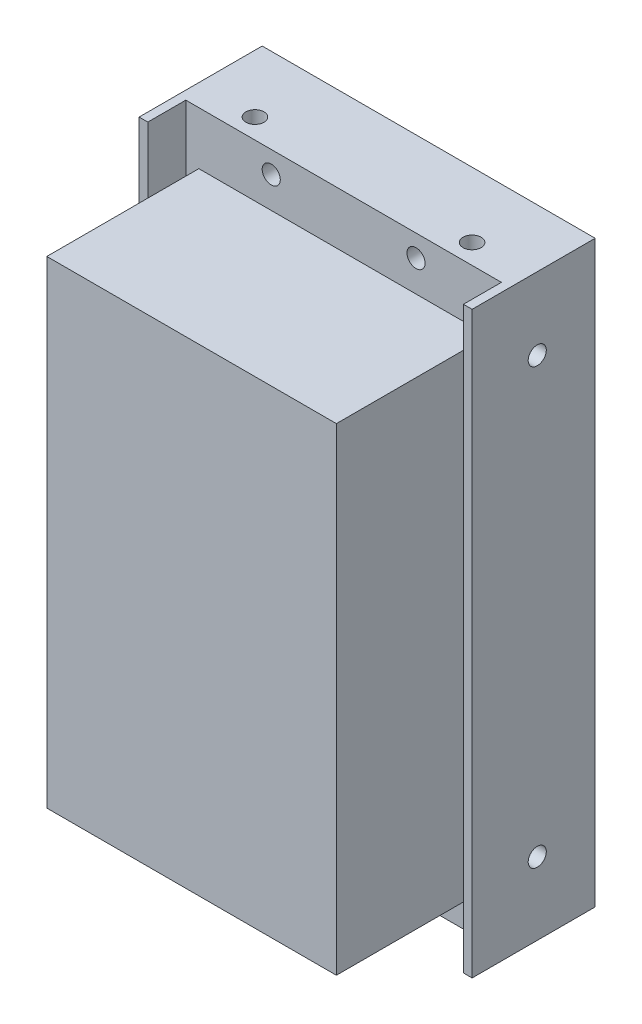
ISO-10303-21;
HEADER;
FILE_DESCRIPTION(('STEP AP214'),'2;1');
FILE_NAME('part.step','',(''),(''),'','','');
FILE_SCHEMA(('AUTOMOTIVE_DESIGN { 1 0 10303 214 1 1 1 1 }'));
ENDSEC;
DATA;
#1=APPLICATION_CONTEXT('core data for automotive mechanical design processes');
#2=APPLICATION_PROTOCOL_DEFINITION('international standard','automotive_design',2000,#1);
#3=PRODUCT_CONTEXT('',#1,'mechanical');
#4=PRODUCT('Part','Part','',(#3));
#5=PRODUCT_RELATED_PRODUCT_CATEGORY('part','',(#4));
#6=PRODUCT_DEFINITION_FORMATION('','',#4);
#7=PRODUCT_DEFINITION_CONTEXT('part definition',#1,'design');
#8=PRODUCT_DEFINITION('design','',#6,#7);
#9=PRODUCT_DEFINITION_SHAPE('','',#8);
#10=(LENGTH_UNIT() NAMED_UNIT(*) SI_UNIT(.MILLI.,.METRE.));
#11=(NAMED_UNIT(*) PLANE_ANGLE_UNIT() SI_UNIT($,.RADIAN.));
#12=(NAMED_UNIT(*) SI_UNIT($,.STERADIAN.) SOLID_ANGLE_UNIT());
#13=UNCERTAINTY_MEASURE_WITH_UNIT(LENGTH_MEASURE(1.E-05),#10,'distance_accuracy_value','');
#14=(GEOMETRIC_REPRESENTATION_CONTEXT(3) GLOBAL_UNCERTAINTY_ASSIGNED_CONTEXT((#13)) GLOBAL_UNIT_ASSIGNED_CONTEXT((#10,
#11,#12)) REPRESENTATION_CONTEXT('',''));
#15=CARTESIAN_POINT('',(0.,0.,0.));
#16=DIRECTION('',(0.,0.,1.));
#17=DIRECTION('',(1.,0.,0.));
#18=AXIS2_PLACEMENT_3D('',#15,#16,#17);
#19=CARTESIAN_POINT('',(-23.,80.,0.));
#20=DIRECTION('',(0.,0.,-1.));
#21=DIRECTION('',(-1.,0.,0.));
#22=AXIS2_PLACEMENT_3D('',#19,#20,#21);
#23=PLANE('',#22);
#24=CARTESIAN_POINT('',(-10.,77.,0.));
#25=DIRECTION('',(0.,0.,1.));
#26=DIRECTION('',(1.,0.,0.));
#27=AXIS2_PLACEMENT_3D('',#24,#25,#26);
#28=CIRCLE('',#27,1.24999999999999);
#29=CARTESIAN_POINT('',(-8.75000000000001,77.,0.));
#30=VERTEX_POINT('',#29);
#31=EDGE_CURVE('E149',#30,#30,#28,.T.);
#32=ORIENTED_EDGE('',*,*,#31,.F.);
#33=EDGE_LOOP('',(#32));
#34=FACE_BOUND('',#33,.T.);
#35=CARTESIAN_POINT('',(10.,77.,0.));
#36=DIRECTION('',(0.,0.,1.));
#37=DIRECTION('',(1.,0.,0.));
#38=AXIS2_PLACEMENT_3D('',#35,#36,#37);
#39=CIRCLE('',#38,1.24999999999999);
#40=CARTESIAN_POINT('',(11.25,77.,0.));
#41=VERTEX_POINT('',#40);
#42=EDGE_CURVE('E155',#41,#41,#39,.T.);
#43=ORIENTED_EDGE('',*,*,#42,.F.);
#44=EDGE_LOOP('',(#43));
#45=FACE_BOUND('',#44,.T.);
#46=CARTESIAN_POINT('',(-10.,3.,0.));
#47=DIRECTION('',(0.,0.,1.));
#48=DIRECTION('',(1.,0.,0.));
#49=AXIS2_PLACEMENT_3D('',#46,#47,#48);
#50=CIRCLE('',#49,1.24999999999999);
#51=CARTESIAN_POINT('',(-8.75000000000001,3.,0.));
#52=VERTEX_POINT('',#51);
#53=EDGE_CURVE('E161',#52,#52,#50,.T.);
#54=ORIENTED_EDGE('',*,*,#53,.F.);
#55=EDGE_LOOP('',(#54));
#56=FACE_BOUND('',#55,.T.);
#57=CARTESIAN_POINT('',(10.,3.,0.));
#58=DIRECTION('',(0.,0.,1.));
#59=DIRECTION('',(1.,0.,0.));
#60=AXIS2_PLACEMENT_3D('',#57,#58,#59);
#61=CIRCLE('',#60,1.24999999999999);
#62=CARTESIAN_POINT('',(11.25,3.,0.));
#63=VERTEX_POINT('',#62);
#64=EDGE_CURVE('E167',#63,#63,#61,.T.);
#65=ORIENTED_EDGE('',*,*,#64,.F.);
#66=EDGE_LOOP('',(#65));
#67=FACE_BOUND('',#66,.T.);
#68=DIRECTION('',(0.,-1.,0.));
#69=VECTOR('',#68,1.);
#70=CARTESIAN_POINT('',(21.8,80.,0.));
#71=LINE('',#70,#69);
#72=CARTESIAN_POINT('',(21.8,80.,0.));
#73=VERTEX_POINT('',#72);
#74=CARTESIAN_POINT('',(21.8,0.,0.));
#75=VERTEX_POINT('',#74);
#76=EDGE_CURVE('E217',#73,#75,#71,.T.);
#77=ORIENTED_EDGE('',*,*,#76,.F.);
#78=DIRECTION('',(1.,0.,0.));
#79=VECTOR('',#78,1.);
#80=CARTESIAN_POINT('',(-23.,80.,0.));
#81=LINE('',#80,#79);
#82=CARTESIAN_POINT('',(-21.8,80.,0.));
#83=VERTEX_POINT('',#82);
#84=EDGE_CURVE('E246',#83,#73,#81,.T.);
#85=ORIENTED_EDGE('',*,*,#84,.F.);
#86=DIRECTION('',(0.,-1.,0.));
#87=VECTOR('',#86,1.);
#88=CARTESIAN_POINT('',(-21.8,80.,0.));
#89=LINE('',#88,#87);
#90=CARTESIAN_POINT('',(-21.8,0.,0.));
#91=VERTEX_POINT('',#90);
#92=EDGE_CURVE('E226',#83,#91,#89,.T.);
#93=ORIENTED_EDGE('',*,*,#92,.T.);
#94=DIRECTION('',(1.,0.,0.));
#95=VECTOR('',#94,1.);
#96=CARTESIAN_POINT('',(-23.,0.,0.));
#97=LINE('',#96,#95);
#98=EDGE_CURVE('E242',#91,#75,#97,.T.);
#99=ORIENTED_EDGE('',*,*,#98,.T.);
#100=EDGE_LOOP('',(#77,#85,#93,#99));
#101=FACE_BOUND('',#100,.T.);
#102=DIRECTION('',(0.,-1.,0.));
#103=VECTOR('',#102,1.);
#104=CARTESIAN_POINT('',(-20.,72.7,0.));
#105=LINE('',#104,#103);
#106=CARTESIAN_POINT('',(-20.,72.7,0.));
#107=VERTEX_POINT('',#106);
#108=CARTESIAN_POINT('',(-20.,6.7,0.));
#109=VERTEX_POINT('',#108);
#110=EDGE_CURVE('E173',#107,#109,#105,.T.);
#111=ORIENTED_EDGE('',*,*,#110,.F.);
#112=DIRECTION('',(-1.,0.,0.));
#113=VECTOR('',#112,1.);
#114=CARTESIAN_POINT('',(-20.,72.7,0.));
#115=LINE('',#114,#113);
#116=CARTESIAN_POINT('',(20.,72.7,0.));
#117=VERTEX_POINT('',#116);
#118=EDGE_CURVE('E178',#117,#107,#115,.T.);
#119=ORIENTED_EDGE('',*,*,#118,.F.);
#120=DIRECTION('',(0.,1.,0.));
#121=VECTOR('',#120,1.);
#122=CARTESIAN_POINT('',(20.,72.7,0.));
#123=LINE('',#122,#121);
#124=CARTESIAN_POINT('',(20.,6.7,0.));
#125=VERTEX_POINT('',#124);
#126=EDGE_CURVE('E55',#125,#117,#123,.T.);
#127=ORIENTED_EDGE('',*,*,#126,.F.);
#128=DIRECTION('',(1.,0.,0.));
#129=VECTOR('',#128,1.);
#130=CARTESIAN_POINT('',(-20.,6.7,0.));
#131=LINE('',#130,#129);
#132=EDGE_CURVE('E50',#109,#125,#131,.T.);
#133=ORIENTED_EDGE('',*,*,#132,.F.);
#134=EDGE_LOOP('',(#111,#119,#127,#133));
#135=FACE_BOUND('',#134,.T.);
#136=ADVANCED_FACE('F35',(#34,#45,#56,#67,#101,#135),#23,.F.);
#137=CARTESIAN_POINT('',(23.,80.,-11.75));
#138=DIRECTION('',(-1.,0.,0.));
#139=DIRECTION('',(0.,0.,1.));
#140=AXIS2_PLACEMENT_3D('',#137,#138,#139);
#141=PLANE('',#140);
#142=CARTESIAN_POINT('',(23.,70.,-3.75));
#143=DIRECTION('',(1.,0.,0.));
#144=DIRECTION('',(0.,0.,-1.));
#145=AXIS2_PLACEMENT_3D('',#142,#143,#144);
#146=CIRCLE('',#145,1.24999999999999);
#147=CARTESIAN_POINT('',(23.,70.,-4.99999999999999));
#148=VERTEX_POINT('',#147);
#149=EDGE_CURVE('E524',#148,#148,#146,.T.);
#150=ORIENTED_EDGE('',*,*,#149,.F.);
#151=EDGE_LOOP('',(#150));
#152=FACE_BOUND('',#151,.T.);
#153=CARTESIAN_POINT('',(23.,10.,-3.75));
#154=DIRECTION('',(1.,0.,0.));
#155=DIRECTION('',(0.,0.,-1.));
#156=AXIS2_PLACEMENT_3D('',#153,#154,#155);
#157=CIRCLE('',#156,1.24999999999999);
#158=CARTESIAN_POINT('',(23.,10.,-4.99999999999999));
#159=VERTEX_POINT('',#158);
#160=EDGE_CURVE('E526',#159,#159,#157,.T.);
#161=ORIENTED_EDGE('',*,*,#160,.F.);
#162=EDGE_LOOP('',(#161));
#163=FACE_BOUND('',#162,.T.);
#164=DIRECTION('',(0.,0.,-1.));
#165=VECTOR('',#164,1.);
#166=CARTESIAN_POINT('',(23.,0.,-11.75));
#167=LINE('',#166,#165);
#168=CARTESIAN_POINT('',(23.,0.,5.25));
#169=VERTEX_POINT('',#168);
#170=CARTESIAN_POINT('',(23.,0.,-11.75));
#171=VERTEX_POINT('',#170);
#172=EDGE_CURVE('E237',#169,#171,#167,.T.);
#173=ORIENTED_EDGE('',*,*,#172,.T.);
#174=DIRECTION('',(0.,-1.,0.));
#175=VECTOR('',#174,1.);
#176=CARTESIAN_POINT('',(23.,80.,-11.75));
#177=LINE('',#176,#175);
#178=CARTESIAN_POINT('',(23.,80.,-11.75));
#179=VERTEX_POINT('',#178);
#180=EDGE_CURVE('E11',#179,#171,#177,.T.);
#181=ORIENTED_EDGE('',*,*,#180,.F.);
#182=DIRECTION('',(0.,0.,-1.));
#183=VECTOR('',#182,1.);
#184=CARTESIAN_POINT('',(23.,80.,-11.75));
#185=LINE('',#184,#183);
#186=CARTESIAN_POINT('',(23.,80.,5.25));
#187=VERTEX_POINT('',#186);
#188=EDGE_CURVE('E238',#187,#179,#185,.T.);
#189=ORIENTED_EDGE('',*,*,#188,.F.);
#190=DIRECTION('',(0.,-1.,0.));
#191=VECTOR('',#190,1.);
#192=CARTESIAN_POINT('',(23.,80.,5.25));
#193=LINE('',#192,#191);
#194=EDGE_CURVE('E208',#187,#169,#193,.T.);
#195=ORIENTED_EDGE('',*,*,#194,.T.);
#196=EDGE_LOOP('',(#173,#181,#189,#195));
#197=FACE_BOUND('',#196,.T.);
#198=ADVANCED_FACE('F37',(#152,#163,#197),#141,.F.);
#199=CARTESIAN_POINT('',(-23.,80.,-11.75));
#200=DIRECTION('',(0.,0.,1.));
#201=DIRECTION('',(1.,0.,0.));
#202=AXIS2_PLACEMENT_3D('',#199,#200,#201);
#203=PLANE('',#202);
#204=CARTESIAN_POINT('',(-10.,77.,-11.75));
#205=DIRECTION('',(0.,0.,1.));
#206=DIRECTION('',(1.,0.,0.));
#207=AXIS2_PLACEMENT_3D('',#204,#205,#206);
#208=CIRCLE('',#207,1.25);
#209=CARTESIAN_POINT('',(-8.75,77.,-11.75));
#210=VERTEX_POINT('',#209);
#211=EDGE_CURVE('E152',#210,#210,#208,.T.);
#212=ORIENTED_EDGE('',*,*,#211,.T.);
#213=EDGE_LOOP('',(#212));
#214=FACE_BOUND('',#213,.T.);
#215=CARTESIAN_POINT('',(10.,77.,-11.75));
#216=DIRECTION('',(0.,0.,1.));
#217=DIRECTION('',(1.,0.,0.));
#218=AXIS2_PLACEMENT_3D('',#215,#216,#217);
#219=CIRCLE('',#218,1.25);
#220=CARTESIAN_POINT('',(11.25,77.,-11.75));
#221=VERTEX_POINT('',#220);
#222=EDGE_CURVE('E158',#221,#221,#219,.T.);
#223=ORIENTED_EDGE('',*,*,#222,.T.);
#224=EDGE_LOOP('',(#223));
#225=FACE_BOUND('',#224,.T.);
#226=CARTESIAN_POINT('',(-10.,3.,-11.75));
#227=DIRECTION('',(0.,0.,1.));
#228=DIRECTION('',(1.,0.,0.));
#229=AXIS2_PLACEMENT_3D('',#226,#227,#228);
#230=CIRCLE('',#229,1.25);
#231=CARTESIAN_POINT('',(-8.75,3.,-11.75));
#232=VERTEX_POINT('',#231);
#233=EDGE_CURVE('E164',#232,#232,#230,.T.);
#234=ORIENTED_EDGE('',*,*,#233,.T.);
#235=EDGE_LOOP('',(#234));
#236=FACE_BOUND('',#235,.T.);
#237=CARTESIAN_POINT('',(10.,3.,-11.75));
#238=DIRECTION('',(0.,0.,1.));
#239=DIRECTION('',(1.,0.,0.));
#240=AXIS2_PLACEMENT_3D('',#237,#238,#239);
#241=CIRCLE('',#240,1.25);
#242=CARTESIAN_POINT('',(11.25,3.,-11.75));
#243=VERTEX_POINT('',#242);
#244=EDGE_CURVE('E170',#243,#243,#241,.T.);
#245=ORIENTED_EDGE('',*,*,#244,.T.);
#246=EDGE_LOOP('',(#245));
#247=FACE_BOUND('',#246,.T.);
#248=DIRECTION('',(-1.,0.,0.));
#249=VECTOR('',#248,1.);
#250=CARTESIAN_POINT('',(-23.,0.,-11.75));
#251=LINE('',#250,#249);
#252=CARTESIAN_POINT('',(-23.,0.,-11.75));
#253=VERTEX_POINT('',#252);
#254=EDGE_CURVE('E251',#171,#253,#251,.T.);
#255=ORIENTED_EDGE('',*,*,#254,.T.);
#256=DIRECTION('',(0.,-1.,0.));
#257=VECTOR('',#256,1.);
#258=CARTESIAN_POINT('',(-23.,80.,-11.75));
#259=LINE('',#258,#257);
#260=CARTESIAN_POINT('',(-23.,80.,-11.75));
#261=VERTEX_POINT('',#260);
#262=EDGE_CURVE('E43',#261,#253,#259,.T.);
#263=ORIENTED_EDGE('',*,*,#262,.F.);
#264=DIRECTION('',(-1.,0.,0.));
#265=VECTOR('',#264,1.);
#266=CARTESIAN_POINT('',(-23.,80.,-11.75));
#267=LINE('',#266,#265);
#268=EDGE_CURVE('E241',#179,#261,#267,.T.);
#269=ORIENTED_EDGE('',*,*,#268,.F.);
#270=ORIENTED_EDGE('',*,*,#180,.T.);
#271=EDGE_LOOP('',(#255,#263,#269,#270));
#272=FACE_BOUND('',#271,.T.);
#273=ADVANCED_FACE('F277',(#214,#225,#236,#247,#272),#203,.F.);
#274=CARTESIAN_POINT('',(-23.,80.,-11.75));
#275=DIRECTION('',(1.,0.,0.));
#276=DIRECTION('',(0.,0.,-1.));
#277=AXIS2_PLACEMENT_3D('',#274,#275,#276);
#278=PLANE('',#277);
#279=CARTESIAN_POINT('',(-23.,70.,-3.74999999999999));
#280=DIRECTION('',(1.,0.,0.));
#281=DIRECTION('',(0.,0.,-1.));
#282=AXIS2_PLACEMENT_3D('',#279,#280,#281);
#283=CIRCLE('',#282,1.24999999999999);
#284=CARTESIAN_POINT('',(-23.,70.,-4.99999999999997));
#285=VERTEX_POINT('',#284);
#286=EDGE_CURVE('E521',#285,#285,#283,.T.);
#287=ORIENTED_EDGE('',*,*,#286,.T.);
#288=EDGE_LOOP('',(#287));
#289=FACE_BOUND('',#288,.T.);
#290=CARTESIAN_POINT('',(-23.,10.,-3.74999999999999));
#291=DIRECTION('',(1.,0.,0.));
#292=DIRECTION('',(0.,0.,-1.));
#293=AXIS2_PLACEMENT_3D('',#290,#291,#292);
#294=CIRCLE('',#293,1.24999999999999);
#295=CARTESIAN_POINT('',(-23.,10.,-4.99999999999998));
#296=VERTEX_POINT('',#295);
#297=EDGE_CURVE('E143',#296,#296,#294,.T.);
#298=ORIENTED_EDGE('',*,*,#297,.T.);
#299=EDGE_LOOP('',(#298));
#300=FACE_BOUND('',#299,.T.);
#301=DIRECTION('',(0.,0.,1.));
#302=VECTOR('',#301,1.);
#303=CARTESIAN_POINT('',(-23.,0.,-11.75));
#304=LINE('',#303,#302);
#305=CARTESIAN_POINT('',(-23.,0.,5.25000000000001));
#306=VERTEX_POINT('',#305);
#307=EDGE_CURVE('E253',#253,#306,#304,.T.);
#308=ORIENTED_EDGE('',*,*,#307,.T.);
#309=DIRECTION('',(0.,-1.,0.));
#310=VECTOR('',#309,1.);
#311=CARTESIAN_POINT('',(-23.,80.,5.25000000000001));
#312=LINE('',#311,#310);
#313=CARTESIAN_POINT('',(-23.,80.,5.25000000000001));
#314=VERTEX_POINT('',#313);
#315=EDGE_CURVE('E234',#314,#306,#312,.T.);
#316=ORIENTED_EDGE('',*,*,#315,.F.);
#317=DIRECTION('',(0.,0.,1.));
#318=VECTOR('',#317,1.);
#319=CARTESIAN_POINT('',(-23.,80.,-11.75));
#320=LINE('',#319,#318);
#321=EDGE_CURVE('E244',#261,#314,#320,.T.);
#322=ORIENTED_EDGE('',*,*,#321,.F.);
#323=ORIENTED_EDGE('',*,*,#262,.T.);
#324=EDGE_LOOP('',(#308,#316,#322,#323));
#325=FACE_BOUND('',#324,.T.);
#326=ADVANCED_FACE('F260',(#289,#300,#325),#278,.F.);
#327=CARTESIAN_POINT('',(0.,80.,0.));
#328=DIRECTION('',(0.,1.,0.));
#329=DIRECTION('',(0.,0.,1.));
#330=AXIS2_PLACEMENT_3D('',#327,#328,#329);
#331=PLANE('',#330);
#332=CARTESIAN_POINT('',(-15.,80.,-2.75));
#333=DIRECTION('',(0.,1.,0.));
#334=DIRECTION('',(0.,0.,1.));
#335=AXIS2_PLACEMENT_3D('',#332,#333,#334);
#336=CIRCLE('',#335,1.24999999999999);
#337=CARTESIAN_POINT('',(-15.,80.,-1.50000000000001));
#338=VERTEX_POINT('',#337);
#339=EDGE_CURVE('E137',#338,#338,#336,.T.);
#340=ORIENTED_EDGE('',*,*,#339,.F.);
#341=EDGE_LOOP('',(#340));
#342=FACE_BOUND('',#341,.T.);
#343=CARTESIAN_POINT('',(15.,80.,-2.75));
#344=DIRECTION('',(0.,1.,0.));
#345=DIRECTION('',(0.,0.,1.));
#346=AXIS2_PLACEMENT_3D('',#343,#344,#345);
#347=CIRCLE('',#346,1.24999999999999);
#348=CARTESIAN_POINT('',(15.,80.,-1.50000000000001));
#349=VERTEX_POINT('',#348);
#350=EDGE_CURVE('E136',#349,#349,#347,.T.);
#351=ORIENTED_EDGE('',*,*,#350,.F.);
#352=EDGE_LOOP('',(#351));
#353=FACE_BOUND('',#352,.T.);
#354=ORIENTED_EDGE('',*,*,#188,.T.);
#355=ORIENTED_EDGE('',*,*,#268,.T.);
#356=ORIENTED_EDGE('',*,*,#321,.T.);
#357=DIRECTION('',(1.,0.,0.));
#358=VECTOR('',#357,1.);
#359=CARTESIAN_POINT('',(-23.,80.,5.25000000000001));
#360=LINE('',#359,#358);
#361=CARTESIAN_POINT('',(-21.8,80.,5.25000000000001));
#362=VERTEX_POINT('',#361);
#363=EDGE_CURVE('E221',#314,#362,#360,.T.);
#364=ORIENTED_EDGE('',*,*,#363,.T.);
#365=DIRECTION('',(0.,0.,-1.));
#366=VECTOR('',#365,1.);
#367=CARTESIAN_POINT('',(-21.8,80.,0.));
#368=LINE('',#367,#366);
#369=EDGE_CURVE('E223',#362,#83,#368,.T.);
#370=ORIENTED_EDGE('',*,*,#369,.T.);
#371=ORIENTED_EDGE('',*,*,#84,.T.);
#372=DIRECTION('',(0.,0.,1.));
#373=VECTOR('',#372,1.);
#374=CARTESIAN_POINT('',(21.8,80.,0.));
#375=LINE('',#374,#373);
#376=CARTESIAN_POINT('',(21.8,80.,5.25));
#377=VERTEX_POINT('',#376);
#378=EDGE_CURVE('E202',#73,#377,#375,.T.);
#379=ORIENTED_EDGE('',*,*,#378,.T.);
#380=DIRECTION('',(1.,0.,0.));
#381=VECTOR('',#380,1.);
#382=CARTESIAN_POINT('',(23.,80.,5.25));
#383=LINE('',#382,#381);
#384=EDGE_CURVE('E204',#377,#187,#383,.T.);
#385=ORIENTED_EDGE('',*,*,#384,.T.);
#386=EDGE_LOOP('',(#354,#355,#356,#364,#370,#371,#379,#385));
#387=FACE_BOUND('',#386,.T.);
#388=ADVANCED_FACE('F274',(#342,#353,#387),#331,.T.);
#389=CARTESIAN_POINT('',(0.,0.,0.));
#390=DIRECTION('',(0.,1.,0.));
#391=DIRECTION('',(0.,0.,1.));
#392=AXIS2_PLACEMENT_3D('',#389,#390,#391);
#393=PLANE('',#392);
#394=ORIENTED_EDGE('',*,*,#172,.F.);
#395=DIRECTION('',(1.,0.,0.));
#396=VECTOR('',#395,1.);
#397=CARTESIAN_POINT('',(23.,0.,5.25));
#398=LINE('',#397,#396);
#399=CARTESIAN_POINT('',(21.8,0.,5.25));
#400=VERTEX_POINT('',#399);
#401=EDGE_CURVE('E205',#400,#169,#398,.T.);
#402=ORIENTED_EDGE('',*,*,#401,.F.);
#403=DIRECTION('',(0.,0.,1.));
#404=VECTOR('',#403,1.);
#405=CARTESIAN_POINT('',(21.8,0.,0.));
#406=LINE('',#405,#404);
#407=EDGE_CURVE('E201',#75,#400,#406,.T.);
#408=ORIENTED_EDGE('',*,*,#407,.F.);
#409=ORIENTED_EDGE('',*,*,#98,.F.);
#410=DIRECTION('',(0.,0.,-1.));
#411=VECTOR('',#410,1.);
#412=CARTESIAN_POINT('',(-21.8,0.,0.));
#413=LINE('',#412,#411);
#414=CARTESIAN_POINT('',(-21.8,0.,5.25000000000001));
#415=VERTEX_POINT('',#414);
#416=EDGE_CURVE('E224',#415,#91,#413,.T.);
#417=ORIENTED_EDGE('',*,*,#416,.F.);
#418=DIRECTION('',(1.,0.,0.));
#419=VECTOR('',#418,1.);
#420=CARTESIAN_POINT('',(-23.,0.,5.25000000000001));
#421=LINE('',#420,#419);
#422=EDGE_CURVE('E220',#306,#415,#421,.T.);
#423=ORIENTED_EDGE('',*,*,#422,.F.);
#424=ORIENTED_EDGE('',*,*,#307,.F.);
#425=ORIENTED_EDGE('',*,*,#254,.F.);
#426=EDGE_LOOP('',(#394,#402,#408,#409,#417,#423,#424,#425));
#427=FACE_BOUND('',#426,.T.);
#428=ADVANCED_FACE('F265',(#427),#393,.F.);
#429=CARTESIAN_POINT('',(-23.,80.,5.25000000000001));
#430=DIRECTION('',(0.,0.,-1.));
#431=DIRECTION('',(-1.,0.,0.));
#432=AXIS2_PLACEMENT_3D('',#429,#430,#431);
#433=PLANE('',#432);
#434=ORIENTED_EDGE('',*,*,#422,.T.);
#435=DIRECTION('',(0.,-1.,0.));
#436=VECTOR('',#435,1.);
#437=CARTESIAN_POINT('',(-21.8,80.,5.25000000000001));
#438=LINE('',#437,#436);
#439=EDGE_CURVE('E231',#362,#415,#438,.T.);
#440=ORIENTED_EDGE('',*,*,#439,.F.);
#441=ORIENTED_EDGE('',*,*,#363,.F.);
#442=ORIENTED_EDGE('',*,*,#315,.T.);
#443=EDGE_LOOP('',(#434,#440,#441,#442));
#444=FACE_BOUND('',#443,.T.);
#445=ADVANCED_FACE('F271',(#444),#433,.F.);
#446=CARTESIAN_POINT('',(-21.8,80.,0.));
#447=DIRECTION('',(-1.,0.,0.));
#448=DIRECTION('',(0.,0.,1.));
#449=AXIS2_PLACEMENT_3D('',#446,#447,#448);
#450=PLANE('',#449);
#451=ORIENTED_EDGE('',*,*,#416,.T.);
#452=ORIENTED_EDGE('',*,*,#92,.F.);
#453=ORIENTED_EDGE('',*,*,#369,.F.);
#454=ORIENTED_EDGE('',*,*,#439,.T.);
#455=EDGE_LOOP('',(#451,#452,#453,#454));
#456=FACE_BOUND('',#455,.T.);
#457=ADVANCED_FACE('F292',(#456),#450,.F.);
#458=CARTESIAN_POINT('',(21.8,80.,0.));
#459=DIRECTION('',(1.,0.,0.));
#460=DIRECTION('',(0.,0.,-1.));
#461=AXIS2_PLACEMENT_3D('',#458,#459,#460);
#462=PLANE('',#461);
#463=ORIENTED_EDGE('',*,*,#407,.T.);
#464=DIRECTION('',(0.,-1.,0.));
#465=VECTOR('',#464,1.);
#466=CARTESIAN_POINT('',(21.8,80.,5.25));
#467=LINE('',#466,#465);
#468=EDGE_CURVE('E214',#377,#400,#467,.T.);
#469=ORIENTED_EDGE('',*,*,#468,.F.);
#470=ORIENTED_EDGE('',*,*,#378,.F.);
#471=ORIENTED_EDGE('',*,*,#76,.T.);
#472=EDGE_LOOP('',(#463,#469,#470,#471));
#473=FACE_BOUND('',#472,.T.);
#474=ADVANCED_FACE('F288',(#473),#462,.F.);
#475=CARTESIAN_POINT('',(23.,80.,5.25));
#476=DIRECTION('',(0.,0.,-1.));
#477=DIRECTION('',(-1.,0.,0.));
#478=AXIS2_PLACEMENT_3D('',#475,#476,#477);
#479=PLANE('',#478);
#480=ORIENTED_EDGE('',*,*,#401,.T.);
#481=ORIENTED_EDGE('',*,*,#194,.F.);
#482=ORIENTED_EDGE('',*,*,#384,.F.);
#483=ORIENTED_EDGE('',*,*,#468,.T.);
#484=EDGE_LOOP('',(#480,#481,#482,#483));
#485=FACE_BOUND('',#484,.T.);
#486=ADVANCED_FACE('F283',(#485),#479,.F.);
#487=CARTESIAN_POINT('',(-20.,72.7,21.));
#488=DIRECTION('',(1.,0.,0.));
#489=DIRECTION('',(0.,0.,-1.));
#490=AXIS2_PLACEMENT_3D('',#487,#488,#489);
#491=PLANE('',#490);
#492=ORIENTED_EDGE('',*,*,#110,.T.);
#493=DIRECTION('',(0.,0.,-1.));
#494=VECTOR('',#493,1.);
#495=CARTESIAN_POINT('',(-20.,6.7,21.));
#496=LINE('',#495,#494);
#497=CARTESIAN_POINT('',(-20.,6.7,21.));
#498=VERTEX_POINT('',#497);
#499=EDGE_CURVE('E199',#498,#109,#496,.T.);
#500=ORIENTED_EDGE('',*,*,#499,.F.);
#501=DIRECTION('',(0.,-1.,0.));
#502=VECTOR('',#501,1.);
#503=CARTESIAN_POINT('',(-20.,72.7,21.));
#504=LINE('',#503,#502);
#505=CARTESIAN_POINT('',(-20.,72.7,21.));
#506=VERTEX_POINT('',#505);
#507=EDGE_CURVE('E174',#506,#498,#504,.T.);
#508=ORIENTED_EDGE('',*,*,#507,.F.);
#509=DIRECTION('',(0.,0.,-1.));
#510=VECTOR('',#509,1.);
#511=CARTESIAN_POINT('',(-20.,72.7,21.));
#512=LINE('',#511,#510);
#513=EDGE_CURVE('E184',#506,#107,#512,.T.);
#514=ORIENTED_EDGE('',*,*,#513,.T.);
#515=EDGE_LOOP('',(#492,#500,#508,#514));
#516=FACE_BOUND('',#515,.T.);
#517=ADVANCED_FACE('F357',(#516),#491,.F.);
#518=CARTESIAN_POINT('',(-20.,6.7,21.));
#519=DIRECTION('',(0.,1.,0.));
#520=DIRECTION('',(0.,0.,1.));
#521=AXIS2_PLACEMENT_3D('',#518,#519,#520);
#522=PLANE('',#521);
#523=ORIENTED_EDGE('',*,*,#132,.T.);
#524=DIRECTION('',(0.,0.,-1.));
#525=VECTOR('',#524,1.);
#526=CARTESIAN_POINT('',(20.,6.7,21.));
#527=LINE('',#526,#525);
#528=CARTESIAN_POINT('',(20.,6.7,21.));
#529=VERTEX_POINT('',#528);
#530=EDGE_CURVE('E196',#529,#125,#527,.T.);
#531=ORIENTED_EDGE('',*,*,#530,.F.);
#532=DIRECTION('',(1.,0.,0.));
#533=VECTOR('',#532,1.);
#534=CARTESIAN_POINT('',(-20.,6.7,21.));
#535=LINE('',#534,#533);
#536=EDGE_CURVE('E177',#498,#529,#535,.T.);
#537=ORIENTED_EDGE('',*,*,#536,.F.);
#538=ORIENTED_EDGE('',*,*,#499,.T.);
#539=EDGE_LOOP('',(#523,#531,#537,#538));
#540=FACE_BOUND('',#539,.T.);
#541=ADVANCED_FACE('F353',(#540),#522,.F.);
#542=CARTESIAN_POINT('',(20.,72.7,21.));
#543=DIRECTION('',(-1.,0.,0.));
#544=DIRECTION('',(0.,0.,1.));
#545=AXIS2_PLACEMENT_3D('',#542,#543,#544);
#546=PLANE('',#545);
#547=ORIENTED_EDGE('',*,*,#126,.T.);
#548=DIRECTION('',(0.,0.,-1.));
#549=VECTOR('',#548,1.);
#550=CARTESIAN_POINT('',(20.,72.7,21.));
#551=LINE('',#550,#549);
#552=CARTESIAN_POINT('',(20.,72.7,21.));
#553=VERTEX_POINT('',#552);
#554=EDGE_CURVE('E193',#553,#117,#551,.T.);
#555=ORIENTED_EDGE('',*,*,#554,.F.);
#556=DIRECTION('',(0.,1.,0.));
#557=VECTOR('',#556,1.);
#558=CARTESIAN_POINT('',(20.,72.7,21.));
#559=LINE('',#558,#557);
#560=EDGE_CURVE('E180',#529,#553,#559,.T.);
#561=ORIENTED_EDGE('',*,*,#560,.F.);
#562=ORIENTED_EDGE('',*,*,#530,.T.);
#563=EDGE_LOOP('',(#547,#555,#561,#562));
#564=FACE_BOUND('',#563,.T.);
#565=ADVANCED_FACE('F349',(#564),#546,.F.);
#566=CARTESIAN_POINT('',(-20.,72.7,21.));
#567=DIRECTION('',(0.,-1.,0.));
#568=DIRECTION('',(0.,0.,-1.));
#569=AXIS2_PLACEMENT_3D('',#566,#567,#568);
#570=PLANE('',#569);
#571=ORIENTED_EDGE('',*,*,#118,.T.);
#572=ORIENTED_EDGE('',*,*,#513,.F.);
#573=DIRECTION('',(-1.,0.,0.));
#574=VECTOR('',#573,1.);
#575=CARTESIAN_POINT('',(-20.,72.7,21.));
#576=LINE('',#575,#574);
#577=EDGE_CURVE('E182',#553,#506,#576,.T.);
#578=ORIENTED_EDGE('',*,*,#577,.F.);
#579=ORIENTED_EDGE('',*,*,#554,.T.);
#580=EDGE_LOOP('',(#571,#572,#578,#579));
#581=FACE_BOUND('',#580,.T.);
#582=ADVANCED_FACE('F342',(#581),#570,.F.);
#583=CARTESIAN_POINT('',(0.,0.,21.));
#584=DIRECTION('',(0.,0.,1.));
#585=DIRECTION('',(1.,0.,0.));
#586=AXIS2_PLACEMENT_3D('',#583,#584,#585);
#587=PLANE('',#586);
#588=ORIENTED_EDGE('',*,*,#507,.T.);
#589=ORIENTED_EDGE('',*,*,#536,.T.);
#590=ORIENTED_EDGE('',*,*,#560,.T.);
#591=ORIENTED_EDGE('',*,*,#577,.T.);
#592=EDGE_LOOP('',(#588,#589,#590,#591));
#593=FACE_BOUND('',#592,.T.);
#594=ADVANCED_FACE('F331',(#593),#587,.T.);
#595=CARTESIAN_POINT('',(10.,3.,0.));
#596=DIRECTION('',(0.,0.,1.));
#597=DIRECTION('',(1.,0.,0.));
#598=AXIS2_PLACEMENT_3D('',#595,#596,#597);
#599=CYLINDRICAL_SURFACE('',#598,1.24999999999999);
#600=ORIENTED_EDGE('',*,*,#244,.F.);
#601=EDGE_LOOP('',(#600));
#602=FACE_BOUND('',#601,.T.);
#603=ORIENTED_EDGE('',*,*,#64,.T.);
#604=EDGE_LOOP('',(#603));
#605=FACE_BOUND('',#604,.T.);
#606=ADVANCED_FACE('F327',(#602,#605),#599,.F.);
#607=CARTESIAN_POINT('',(-10.,3.,0.));
#608=DIRECTION('',(0.,0.,1.));
#609=DIRECTION('',(1.,0.,0.));
#610=AXIS2_PLACEMENT_3D('',#607,#608,#609);
#611=CYLINDRICAL_SURFACE('',#610,1.24999999999999);
#612=ORIENTED_EDGE('',*,*,#233,.F.);
#613=EDGE_LOOP('',(#612));
#614=FACE_BOUND('',#613,.T.);
#615=ORIENTED_EDGE('',*,*,#53,.T.);
#616=EDGE_LOOP('',(#615));
#617=FACE_BOUND('',#616,.T.);
#618=ADVANCED_FACE('F330',(#614,#617),#611,.F.);
#619=CARTESIAN_POINT('',(10.,77.,0.));
#620=DIRECTION('',(0.,0.,1.));
#621=DIRECTION('',(1.,0.,0.));
#622=AXIS2_PLACEMENT_3D('',#619,#620,#621);
#623=CYLINDRICAL_SURFACE('',#622,1.24999999999999);
#624=ORIENTED_EDGE('',*,*,#222,.F.);
#625=EDGE_LOOP('',(#624));
#626=FACE_BOUND('',#625,.T.);
#627=ORIENTED_EDGE('',*,*,#42,.T.);
#628=EDGE_LOOP('',(#627));
#629=FACE_BOUND('',#628,.T.);
#630=ADVANCED_FACE('F339',(#626,#629),#623,.F.);
#631=CARTESIAN_POINT('',(-10.,77.,0.));
#632=DIRECTION('',(0.,0.,1.));
#633=DIRECTION('',(1.,0.,0.));
#634=AXIS2_PLACEMENT_3D('',#631,#632,#633);
#635=CYLINDRICAL_SURFACE('',#634,1.24999999999999);
#636=ORIENTED_EDGE('',*,*,#211,.F.);
#637=EDGE_LOOP('',(#636));
#638=FACE_BOUND('',#637,.T.);
#639=ORIENTED_EDGE('',*,*,#31,.T.);
#640=EDGE_LOOP('',(#639));
#641=FACE_BOUND('',#640,.T.);
#642=ADVANCED_FACE('F421',(#638,#641),#635,.F.);
#643=CARTESIAN_POINT('',(15.,75.,-2.75));
#644=DIRECTION('',(0.,1.,0.));
#645=DIRECTION('',(0.,0.,1.));
#646=AXIS2_PLACEMENT_3D('',#643,#644,#645);
#647=CONICAL_SURFACE('',#646,1.25,1.02974425867666);
#648=CARTESIAN_POINT('',(15.,74.2489242262155,-2.75));
#649=VERTEX_POINT('',#648);
#650=VERTEX_LOOP('',#649);
#651=FACE_BOUND('',#650,.T.);
#652=CARTESIAN_POINT('',(15.,75.,-2.75));
#653=DIRECTION('',(0.,1.,0.));
#654=DIRECTION('',(0.,0.,1.));
#655=AXIS2_PLACEMENT_3D('',#652,#653,#654);
#656=CIRCLE('',#655,1.25);
#657=CARTESIAN_POINT('',(15.,75.,-1.5));
#658=VERTEX_POINT('',#657);
#659=EDGE_CURVE('E140',#658,#658,#656,.T.);
#660=ORIENTED_EDGE('',*,*,#659,.T.);
#661=EDGE_LOOP('',(#660));
#662=FACE_BOUND('',#661,.T.);
#663=ADVANCED_FACE('F431',(#651,#662),#647,.F.);
#664=CARTESIAN_POINT('',(15.,80.,-2.75));
#665=DIRECTION('',(0.,1.,0.));
#666=DIRECTION('',(0.,0.,1.));
#667=AXIS2_PLACEMENT_3D('',#664,#665,#666);
#668=CYLINDRICAL_SURFACE('',#667,1.24999999999999);
#669=ORIENTED_EDGE('',*,*,#659,.F.);
#670=EDGE_LOOP('',(#669));
#671=FACE_BOUND('',#670,.T.);
#672=ORIENTED_EDGE('',*,*,#350,.T.);
#673=EDGE_LOOP('',(#672));
#674=FACE_BOUND('',#673,.T.);
#675=ADVANCED_FACE('F130',(#671,#674),#668,.F.);
#676=CARTESIAN_POINT('',(-15.,75.,-2.75));
#677=DIRECTION('',(0.,1.,0.));
#678=DIRECTION('',(0.,0.,1.));
#679=AXIS2_PLACEMENT_3D('',#676,#677,#678);
#680=CONICAL_SURFACE('',#679,1.25,1.02974425867666);
#681=CARTESIAN_POINT('',(-15.,74.2489242262155,-2.75));
#682=VERTEX_POINT('',#681);
#683=VERTEX_LOOP('',#682);
#684=FACE_BOUND('',#683,.T.);
#685=CARTESIAN_POINT('',(-15.,75.,-2.75));
#686=DIRECTION('',(0.,1.,0.));
#687=DIRECTION('',(0.,0.,1.));
#688=AXIS2_PLACEMENT_3D('',#685,#686,#687);
#689=CIRCLE('',#688,1.25);
#690=CARTESIAN_POINT('',(-15.,75.,-1.5));
#691=VERTEX_POINT('',#690);
#692=EDGE_CURVE('E134',#691,#691,#689,.T.);
#693=ORIENTED_EDGE('',*,*,#692,.T.);
#694=EDGE_LOOP('',(#693));
#695=FACE_BOUND('',#694,.T.);
#696=ADVANCED_FACE('F126',(#684,#695),#680,.F.);
#697=CARTESIAN_POINT('',(-15.,80.,-2.75));
#698=DIRECTION('',(0.,1.,0.));
#699=DIRECTION('',(0.,0.,1.));
#700=AXIS2_PLACEMENT_3D('',#697,#698,#699);
#701=CYLINDRICAL_SURFACE('',#700,1.24999999999999);
#702=ORIENTED_EDGE('',*,*,#692,.F.);
#703=EDGE_LOOP('',(#702));
#704=FACE_BOUND('',#703,.T.);
#705=ORIENTED_EDGE('',*,*,#339,.T.);
#706=EDGE_LOOP('',(#705));
#707=FACE_BOUND('',#706,.T.);
#708=ADVANCED_FACE('F129',(#704,#707),#701,.F.);
#709=CARTESIAN_POINT('',(23.,10.,-3.75));
#710=DIRECTION('',(1.,0.,0.));
#711=DIRECTION('',(0.,0.,-1.));
#712=AXIS2_PLACEMENT_3D('',#709,#710,#711);
#713=CYLINDRICAL_SURFACE('',#712,1.24999999999999);
#714=ORIENTED_EDGE('',*,*,#297,.F.);
#715=EDGE_LOOP('',(#714));
#716=FACE_BOUND('',#715,.T.);
#717=ORIENTED_EDGE('',*,*,#160,.T.);
#718=EDGE_LOOP('',(#717));
#719=FACE_BOUND('',#718,.T.);
#720=ADVANCED_FACE('F478',(#716,#719),#713,.F.);
#721=CARTESIAN_POINT('',(23.,70.,-3.75));
#722=DIRECTION('',(1.,0.,0.));
#723=DIRECTION('',(0.,0.,-1.));
#724=AXIS2_PLACEMENT_3D('',#721,#722,#723);
#725=CYLINDRICAL_SURFACE('',#724,1.24999999999999);
#726=ORIENTED_EDGE('',*,*,#286,.F.);
#727=EDGE_LOOP('',(#726));
#728=FACE_BOUND('',#727,.T.);
#729=ORIENTED_EDGE('',*,*,#149,.T.);
#730=EDGE_LOOP('',(#729));
#731=FACE_BOUND('',#730,.T.);
#732=ADVANCED_FACE('F500',(#728,#731),#725,.F.);
#733=CLOSED_SHELL('',(#136,#198,#273,#326,#388,#428,#445,#457,#474,#486,#517,#541,#565,#582,
#594,#606,#618,#630,#642,#663,#675,#696,#708,#720,#732));
#734=MANIFOLD_SOLID_BREP('B2',#733);
#735=ADVANCED_BREP_SHAPE_REPRESENTATION('',(#18,#734),#14);
#736=SHAPE_DEFINITION_REPRESENTATION(#9,#735);
ENDSEC;
END-ISO-10303-21;
